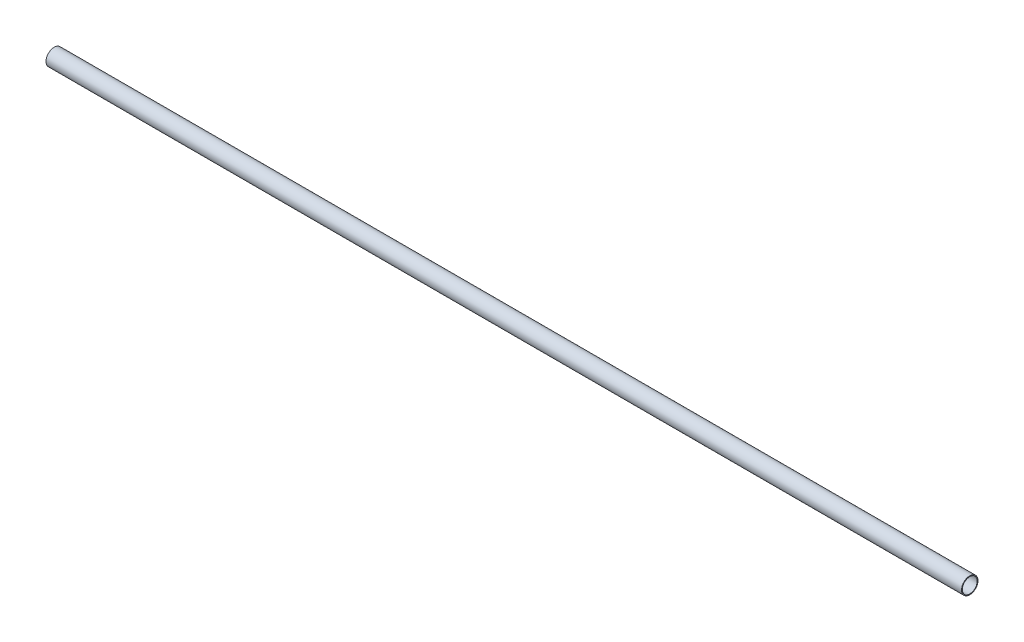
ISO-10303-21;
HEADER;
FILE_DESCRIPTION(('STEP AP214'),'2;1');
FILE_NAME('part.step','',(''),(''),'','','');
FILE_SCHEMA(('AUTOMOTIVE_DESIGN { 1 0 10303 214 1 1 1 1 }'));
ENDSEC;
DATA;
#1=APPLICATION_CONTEXT('core data for automotive mechanical design processes');
#2=APPLICATION_PROTOCOL_DEFINITION('international standard','automotive_design',2000,#1);
#3=PRODUCT_CONTEXT('',#1,'mechanical');
#4=PRODUCT('Part','Part','',(#3));
#5=PRODUCT_RELATED_PRODUCT_CATEGORY('part','',(#4));
#6=PRODUCT_DEFINITION_FORMATION('','',#4);
#7=PRODUCT_DEFINITION_CONTEXT('part definition',#1,'design');
#8=PRODUCT_DEFINITION('design','',#6,#7);
#9=PRODUCT_DEFINITION_SHAPE('','',#8);
#10=(LENGTH_UNIT() NAMED_UNIT(*) SI_UNIT(.MILLI.,.METRE.));
#11=(NAMED_UNIT(*) PLANE_ANGLE_UNIT() SI_UNIT($,.RADIAN.));
#12=(NAMED_UNIT(*) SI_UNIT($,.STERADIAN.) SOLID_ANGLE_UNIT());
#13=UNCERTAINTY_MEASURE_WITH_UNIT(LENGTH_MEASURE(1.E-05),#10,'distance_accuracy_value','');
#14=(GEOMETRIC_REPRESENTATION_CONTEXT(3) GLOBAL_UNCERTAINTY_ASSIGNED_CONTEXT((#13)) GLOBAL_UNIT_ASSIGNED_CONTEXT((#10,
#11,#12)) REPRESENTATION_CONTEXT('',''));
#15=CARTESIAN_POINT('',(0.,0.,0.));
#16=DIRECTION('',(0.,0.,1.));
#17=DIRECTION('',(1.,0.,0.));
#18=AXIS2_PLACEMENT_3D('',#15,#16,#17);
#19=CARTESIAN_POINT('',(0.,0.,0.));
#20=DIRECTION('',(1.,0.,0.));
#21=DIRECTION('',(0.,0.,-1.));
#22=AXIS2_PLACEMENT_3D('',#19,#20,#21);
#23=CYLINDRICAL_SURFACE('',#22,40.7);
#24=CARTESIAN_POINT('',(0.,0.,0.));
#25=DIRECTION('',(1.,0.,0.));
#26=DIRECTION('',(0.,0.,-1.));
#27=AXIS2_PLACEMENT_3D('',#24,#25,#26);
#28=CIRCLE('',#27,40.7);
#29=CARTESIAN_POINT('',(0.,0.,-40.7));
#30=VERTEX_POINT('',#29);
#31=EDGE_CURVE('E16',#30,#30,#28,.T.);
#32=ORIENTED_EDGE('',*,*,#31,.F.);
#33=EDGE_LOOP('',(#32));
#34=FACE_BOUND('',#33,.T.);
#35=CARTESIAN_POINT('',(5000.,0.,0.));
#36=DIRECTION('',(1.,0.,0.));
#37=DIRECTION('',(0.,0.,-1.));
#38=AXIS2_PLACEMENT_3D('',#35,#36,#37);
#39=CIRCLE('',#38,40.7);
#40=CARTESIAN_POINT('',(5000.,0.,-40.7));
#41=VERTEX_POINT('',#40);
#42=EDGE_CURVE('E25',#41,#41,#39,.F.);
#43=ORIENTED_EDGE('',*,*,#42,.F.);
#44=EDGE_LOOP('',(#43));
#45=FACE_BOUND('',#44,.T.);
#46=ADVANCED_FACE('F13',(#34,#45),#23,.F.);
#47=CARTESIAN_POINT('',(0.,-45.5400021084901,-45.));
#48=DIRECTION('',(-1.,0.,0.));
#49=DIRECTION('',(0.,0.,1.));
#50=AXIS2_PLACEMENT_3D('',#47,#48,#49);
#51=PLANE('',#50);
#52=ORIENTED_EDGE('',*,*,#31,.T.);
#53=EDGE_LOOP('',(#52));
#54=FACE_BOUND('',#53,.T.);
#55=CARTESIAN_POINT('',(0.,0.,0.));
#56=DIRECTION('',(1.,0.,0.));
#57=DIRECTION('',(0.,0.,-1.));
#58=AXIS2_PLACEMENT_3D('',#55,#56,#57);
#59=CIRCLE('',#58,45.);
#60=CARTESIAN_POINT('',(0.,0.,-45.));
#61=VERTEX_POINT('',#60);
#62=EDGE_CURVE('E20',#61,#61,#59,.T.);
#63=ORIENTED_EDGE('',*,*,#62,.F.);
#64=EDGE_LOOP('',(#63));
#65=FACE_BOUND('',#64,.T.);
#66=ADVANCED_FACE('F33',(#54,#65),#51,.T.);
#67=CARTESIAN_POINT('',(5000.,-45.5400021084901,45.));
#68=DIRECTION('',(1.,0.,0.));
#69=DIRECTION('',(0.,0.,-1.));
#70=AXIS2_PLACEMENT_3D('',#67,#68,#69);
#71=PLANE('',#70);
#72=ORIENTED_EDGE('',*,*,#42,.T.);
#73=EDGE_LOOP('',(#72));
#74=FACE_BOUND('',#73,.T.);
#75=CARTESIAN_POINT('',(5000.,0.,0.));
#76=DIRECTION('',(1.,0.,0.));
#77=DIRECTION('',(0.,0.,-1.));
#78=AXIS2_PLACEMENT_3D('',#75,#76,#77);
#79=CIRCLE('',#78,45.);
#80=CARTESIAN_POINT('',(5000.,0.,-45.));
#81=VERTEX_POINT('',#80);
#82=EDGE_CURVE('E8',#81,#81,#79,.F.);
#83=ORIENTED_EDGE('',*,*,#82,.F.);
#84=EDGE_LOOP('',(#83));
#85=FACE_BOUND('',#84,.T.);
#86=ADVANCED_FACE('F42',(#74,#85),#71,.T.);
#87=CARTESIAN_POINT('',(5000.,0.,0.));
#88=DIRECTION('',(1.,0.,0.));
#89=DIRECTION('',(0.,0.,-1.));
#90=AXIS2_PLACEMENT_3D('',#87,#88,#89);
#91=CYLINDRICAL_SURFACE('',#90,45.);
#92=ORIENTED_EDGE('',*,*,#62,.T.);
#93=EDGE_LOOP('',(#92));
#94=FACE_BOUND('',#93,.T.);
#95=ORIENTED_EDGE('',*,*,#82,.T.);
#96=EDGE_LOOP('',(#95));
#97=FACE_BOUND('',#96,.T.);
#98=ADVANCED_FACE('F43',(#94,#97),#91,.T.);
#99=CLOSED_SHELL('',(#46,#66,#86,#98));
#100=MANIFOLD_SOLID_BREP('B1',#99);
#101=ADVANCED_BREP_SHAPE_REPRESENTATION('',(#18,#100),#14);
#102=SHAPE_DEFINITION_REPRESENTATION(#9,#101);
ENDSEC;
END-ISO-10303-21;
